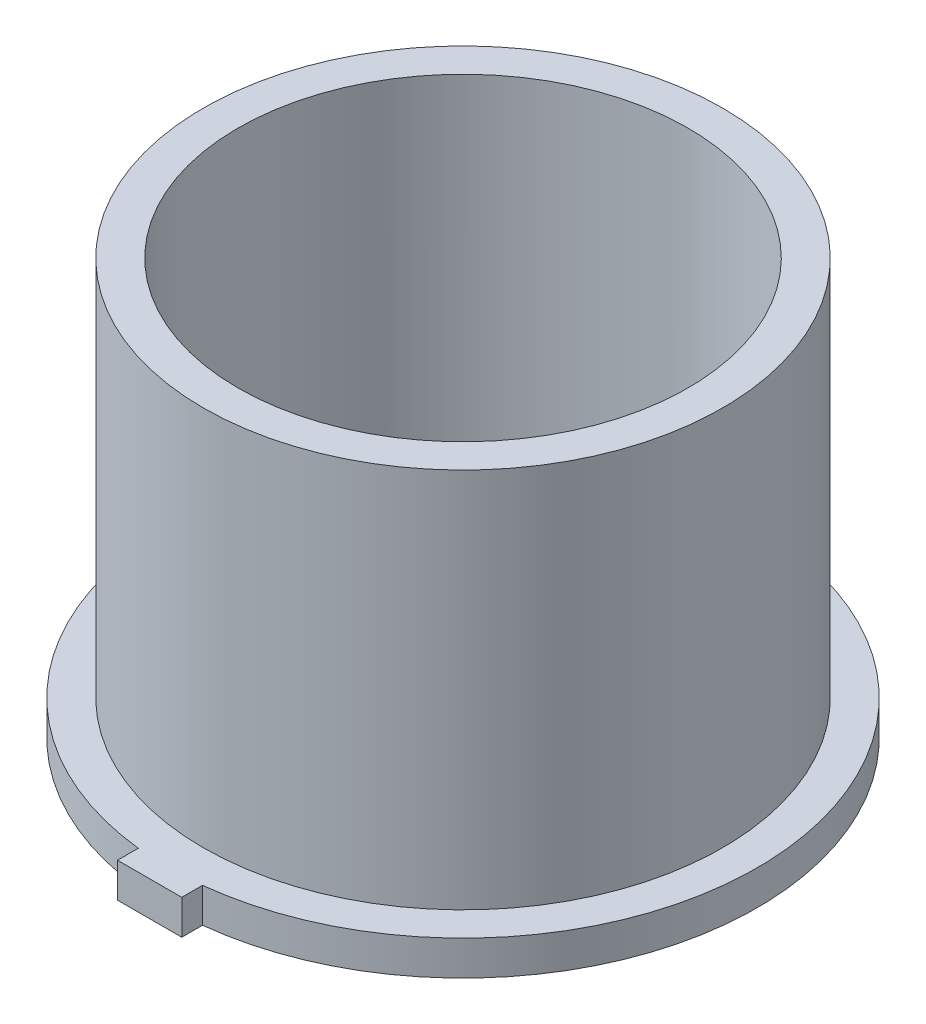
ISO-10303-21;
HEADER;
FILE_DESCRIPTION(('STEP AP214'),'2;1');
FILE_NAME('part.step','',(''),(''),'','','');
FILE_SCHEMA(('AUTOMOTIVE_DESIGN { 1 0 10303 214 1 1 1 1 }'));
ENDSEC;
DATA;
#1=APPLICATION_CONTEXT('core data for automotive mechanical design processes');
#2=APPLICATION_PROTOCOL_DEFINITION('international standard','automotive_design',2000,#1);
#3=PRODUCT_CONTEXT('',#1,'mechanical');
#4=PRODUCT('Part','Part','',(#3));
#5=PRODUCT_RELATED_PRODUCT_CATEGORY('part','',(#4));
#6=PRODUCT_DEFINITION_FORMATION('','',#4);
#7=PRODUCT_DEFINITION_CONTEXT('part definition',#1,'design');
#8=PRODUCT_DEFINITION('design','',#6,#7);
#9=PRODUCT_DEFINITION_SHAPE('','',#8);
#10=(LENGTH_UNIT() NAMED_UNIT(*) SI_UNIT(.MILLI.,.METRE.));
#11=(NAMED_UNIT(*) PLANE_ANGLE_UNIT() SI_UNIT($,.RADIAN.));
#12=(NAMED_UNIT(*) SI_UNIT($,.STERADIAN.) SOLID_ANGLE_UNIT());
#13=UNCERTAINTY_MEASURE_WITH_UNIT(LENGTH_MEASURE(1.E-05),#10,'distance_accuracy_value','');
#14=(GEOMETRIC_REPRESENTATION_CONTEXT(3) GLOBAL_UNCERTAINTY_ASSIGNED_CONTEXT((#13)) GLOBAL_UNIT_ASSIGNED_CONTEXT((#10,
#11,#12)) REPRESENTATION_CONTEXT('',''));
#15=CARTESIAN_POINT('',(0.,0.,0.));
#16=DIRECTION('',(0.,0.,1.));
#17=DIRECTION('',(1.,0.,0.));
#18=AXIS2_PLACEMENT_3D('',#15,#16,#17);
#19=CARTESIAN_POINT('',(0.,5.,0.));
#20=DIRECTION('',(0.,1.,0.));
#21=DIRECTION('',(0.,0.,1.));
#22=AXIS2_PLACEMENT_3D('',#19,#20,#21);
#23=PLANE('',#22);
#24=DIRECTION('',(0.5,0.,0.866025403784439));
#25=VECTOR('',#24,1.);
#26=CARTESIAN_POINT('',(3.75277674973257,5.,-6.5));
#27=LINE('',#26,#25);
#28=CARTESIAN_POINT('',(3.75277674973257,5.,-6.5));
#29=VERTEX_POINT('',#28);
#30=CARTESIAN_POINT('',(7.50555349946514,5.,0.));
#31=VERTEX_POINT('',#30);
#32=EDGE_CURVE('E257',#29,#31,#27,.T.);
#33=ORIENTED_EDGE('',*,*,#32,.T.);
#34=DIRECTION('',(-0.5,0.,0.866025403784439));
#35=VECTOR('',#34,1.);
#36=CARTESIAN_POINT('',(7.50555349946514,5.,0.));
#37=LINE('',#36,#35);
#38=CARTESIAN_POINT('',(3.75277674973257,5.,6.5));
#39=VERTEX_POINT('',#38);
#40=EDGE_CURVE('E260',#31,#39,#37,.T.);
#41=ORIENTED_EDGE('',*,*,#40,.T.);
#42=DIRECTION('',(-1.,0.,0.));
#43=VECTOR('',#42,1.);
#44=CARTESIAN_POINT('',(3.75277674973257,5.,6.5));
#45=LINE('',#44,#43);
#46=CARTESIAN_POINT('',(-3.75277674973257,5.,6.5));
#47=VERTEX_POINT('',#46);
#48=EDGE_CURVE('E51',#39,#47,#45,.T.);
#49=ORIENTED_EDGE('',*,*,#48,.T.);
#50=DIRECTION('',(-0.5,0.,-0.866025403784439));
#51=VECTOR('',#50,1.);
#52=CARTESIAN_POINT('',(-3.75277674973257,5.,6.5));
#53=LINE('',#52,#51);
#54=CARTESIAN_POINT('',(-7.50555349946513,5.,0.));
#55=VERTEX_POINT('',#54);
#56=EDGE_CURVE('E265',#47,#55,#53,.T.);
#57=ORIENTED_EDGE('',*,*,#56,.T.);
#58=DIRECTION('',(0.5,0.,-0.866025403784439));
#59=VECTOR('',#58,1.);
#60=CARTESIAN_POINT('',(-7.50555349946513,5.,0.));
#61=LINE('',#60,#59);
#62=CARTESIAN_POINT('',(-3.75277674973257,5.,-6.5));
#63=VERTEX_POINT('',#62);
#64=EDGE_CURVE('E268',#55,#63,#61,.T.);
#65=ORIENTED_EDGE('',*,*,#64,.T.);
#66=DIRECTION('',(1.,0.,0.));
#67=VECTOR('',#66,1.);
#68=CARTESIAN_POINT('',(-3.75277674973257,5.,-6.5));
#69=LINE('',#68,#67);
#70=EDGE_CURVE('E271',#63,#29,#69,.T.);
#71=ORIENTED_EDGE('',*,*,#70,.T.);
#72=EDGE_LOOP('',(#33,#41,#49,#57,#65,#71));
#73=FACE_BOUND('',#72,.T.);
#74=CARTESIAN_POINT('',(0.,5.,0.));
#75=DIRECTION('',(0.,1.,0.));
#76=DIRECTION('',(0.,0.,1.));
#77=AXIS2_PLACEMENT_3D('',#74,#75,#76);
#78=CIRCLE('',#77,32.5);
#79=CARTESIAN_POINT('',(-4.63627719035668,5.,-32.1676069021955));
#80=VERTEX_POINT('',#79);
#81=CARTESIAN_POINT('',(4.63627719035667,5.,-32.1676069021956));
#82=VERTEX_POINT('',#81);
#83=EDGE_CURVE('E248',#80,#82,#78,.F.);
#84=ORIENTED_EDGE('',*,*,#83,.F.);
#85=DIRECTION('',(0.,0.,-1.));
#86=VECTOR('',#85,1.);
#87=CARTESIAN_POINT('',(-4.63627719035668,5.,-32.1676069021955));
#88=LINE('',#87,#86);
#89=CARTESIAN_POINT('',(-4.63627719035668,5.,-9.00000000000001));
#90=VERTEX_POINT('',#89);
#91=EDGE_CURVE('E310',#90,#80,#88,.T.);
#92=ORIENTED_EDGE('',*,*,#91,.F.);
#93=DIRECTION('',(1.,0.,0.));
#94=VECTOR('',#93,1.);
#95=CARTESIAN_POINT('',(-4.63627719035668,5.,-9.00000000000001));
#96=LINE('',#95,#94);
#97=CARTESIAN_POINT('',(-5.19615242270663,5.,-9.));
#98=VERTEX_POINT('',#97);
#99=EDGE_CURVE('E307',#98,#90,#96,.T.);
#100=ORIENTED_EDGE('',*,*,#99,.F.);
#101=DIRECTION('',(0.5,0.,-0.866025403784438));
#102=VECTOR('',#101,1.);
#103=CARTESIAN_POINT('',(-5.19615242270663,5.,-9.));
#104=LINE('',#103,#102);
#105=CARTESIAN_POINT('',(-10.3923048454133,5.,0.));
#106=VERTEX_POINT('',#105);
#107=EDGE_CURVE('E305',#106,#98,#104,.T.);
#108=ORIENTED_EDGE('',*,*,#107,.F.);
#109=DIRECTION('',(-0.5,0.,-0.866025403784439));
#110=VECTOR('',#109,1.);
#111=CARTESIAN_POINT('',(-10.3923048454133,5.,0.));
#112=LINE('',#111,#110);
#113=CARTESIAN_POINT('',(-5.19615242270664,5.,9.));
#114=VERTEX_POINT('',#113);
#115=EDGE_CURVE('E303',#114,#106,#112,.T.);
#116=ORIENTED_EDGE('',*,*,#115,.F.);
#117=DIRECTION('',(-1.,0.,0.));
#118=VECTOR('',#117,1.);
#119=CARTESIAN_POINT('',(-5.19615242270664,5.,9.));
#120=LINE('',#119,#118);
#121=CARTESIAN_POINT('',(-4.63627719035668,5.,9.));
#122=VERTEX_POINT('',#121);
#123=EDGE_CURVE('E227',#122,#114,#120,.T.);
#124=ORIENTED_EDGE('',*,*,#123,.F.);
#125=DIRECTION('',(0.,0.,-1.));
#126=VECTOR('',#125,1.);
#127=CARTESIAN_POINT('',(-4.63627719035668,5.,9.));
#128=LINE('',#127,#126);
#129=CARTESIAN_POINT('',(-4.63627719035668,5.,32.1676069021955));
#130=VERTEX_POINT('',#129);
#131=EDGE_CURVE('E220',#130,#122,#128,.T.);
#132=ORIENTED_EDGE('',*,*,#131,.F.);
#133=CARTESIAN_POINT('',(4.63627719035668,5.,32.1676069021955));
#134=VERTEX_POINT('',#133);
#135=EDGE_CURVE('E224',#134,#130,#78,.F.);
#136=ORIENTED_EDGE('',*,*,#135,.F.);
#137=DIRECTION('',(0.,0.,1.));
#138=VECTOR('',#137,1.);
#139=CARTESIAN_POINT('',(4.63627719035668,5.,9.));
#140=LINE('',#139,#138);
#141=CARTESIAN_POINT('',(4.63627719035668,5.,9.));
#142=VERTEX_POINT('',#141);
#143=EDGE_CURVE('E343',#142,#134,#140,.T.);
#144=ORIENTED_EDGE('',*,*,#143,.F.);
#145=DIRECTION('',(-1.,0.,0.));
#146=VECTOR('',#145,1.);
#147=CARTESIAN_POINT('',(4.63627719035668,5.,9.));
#148=LINE('',#147,#146);
#149=CARTESIAN_POINT('',(5.19615242270663,5.,9.));
#150=VERTEX_POINT('',#149);
#151=EDGE_CURVE('E341',#150,#142,#148,.T.);
#152=ORIENTED_EDGE('',*,*,#151,.F.);
#153=DIRECTION('',(-0.5,0.,0.866025403784439));
#154=VECTOR('',#153,1.);
#155=CARTESIAN_POINT('',(5.19615242270663,5.,9.));
#156=LINE('',#155,#154);
#157=CARTESIAN_POINT('',(10.3923048454133,5.,0.));
#158=VERTEX_POINT('',#157);
#159=EDGE_CURVE('E353',#158,#150,#156,.T.);
#160=ORIENTED_EDGE('',*,*,#159,.F.);
#161=DIRECTION('',(0.5,0.,0.866025403784439));
#162=VECTOR('',#161,1.);
#163=CARTESIAN_POINT('',(10.3923048454133,5.,0.));
#164=LINE('',#163,#162);
#165=CARTESIAN_POINT('',(5.19615242270664,5.,-9.));
#166=VERTEX_POINT('',#165);
#167=EDGE_CURVE('E350',#166,#158,#164,.T.);
#168=ORIENTED_EDGE('',*,*,#167,.F.);
#169=DIRECTION('',(1.,0.,0.));
#170=VECTOR('',#169,1.);
#171=CARTESIAN_POINT('',(5.19615242270664,5.,-9.));
#172=LINE('',#171,#170);
#173=CARTESIAN_POINT('',(4.63627719035668,5.,-9.00000000000001));
#174=VERTEX_POINT('',#173);
#175=EDGE_CURVE('E348',#174,#166,#172,.T.);
#176=ORIENTED_EDGE('',*,*,#175,.F.);
#177=DIRECTION('',(0.,0.,1.));
#178=VECTOR('',#177,1.);
#179=CARTESIAN_POINT('',(4.63627719035668,5.,-32.1676069021955));
#180=LINE('',#179,#178);
#181=EDGE_CURVE('E346',#82,#174,#180,.T.);
#182=ORIENTED_EDGE('',*,*,#181,.F.);
#183=EDGE_LOOP('',(#84,#92,#100,#108,#116,#124,#132,#136,#144,#152,#160,#168,#176,#182));
#184=FACE_BOUND('',#183,.T.);
#185=ADVANCED_FACE('F36',(#73,#184),#23,.T.);
#186=CARTESIAN_POINT('',(0.,5.,0.));
#187=DIRECTION('',(0.,1.,0.));
#188=DIRECTION('',(0.,0.,1.));
#189=AXIS2_PLACEMENT_3D('',#186,#187,#188);
#190=CIRCLE('',#189,37.5);
#191=CARTESIAN_POINT('',(0.,5.,37.5));
#192=VERTEX_POINT('',#191);
#193=EDGE_CURVE('E247',#192,#192,#190,.F.);
#194=ORIENTED_EDGE('',*,*,#193,.T.);
#195=EDGE_LOOP('',(#194));
#196=FACE_BOUND('',#195,.T.);
#197=CARTESIAN_POINT('',(0.,5.,0.));
#198=DIRECTION('',(0.,1.,0.));
#199=DIRECTION('',(0.,0.,1.));
#200=AXIS2_PLACEMENT_3D('',#197,#198,#199);
#201=CIRCLE('',#200,42.5);
#202=CARTESIAN_POINT('',(-4.63627719035671,5.,-42.246360006682));
#203=VERTEX_POINT('',#202);
#204=CARTESIAN_POINT('',(-4.63627719035668,5.,42.246360006682));
#205=VERTEX_POINT('',#204);
#206=EDGE_CURVE('E390',#203,#205,#201,.T.);
#207=ORIENTED_EDGE('',*,*,#206,.T.);
#208=DIRECTION('',(0.,0.,1.));
#209=VECTOR('',#208,1.);
#210=CARTESIAN_POINT('',(-4.63627719035668,5.,42.246360006682));
#211=LINE('',#210,#209);
#212=CARTESIAN_POINT('',(-4.63627719035668,5.,45.246360006682));
#213=VERTEX_POINT('',#212);
#214=EDGE_CURVE('E393',#205,#213,#211,.T.);
#215=ORIENTED_EDGE('',*,*,#214,.T.);
#216=DIRECTION('',(1.,0.,0.));
#217=VECTOR('',#216,1.);
#218=CARTESIAN_POINT('',(-4.63627719035668,5.,45.246360006682));
#219=LINE('',#218,#217);
#220=CARTESIAN_POINT('',(4.63627719035668,5.,45.246360006682));
#221=VERTEX_POINT('',#220);
#222=EDGE_CURVE('E396',#213,#221,#219,.T.);
#223=ORIENTED_EDGE('',*,*,#222,.T.);
#224=DIRECTION('',(0.,0.,-1.));
#225=VECTOR('',#224,1.);
#226=CARTESIAN_POINT('',(4.63627719035668,5.,45.246360006682));
#227=LINE('',#226,#225);
#228=CARTESIAN_POINT('',(4.63627719035668,5.,42.246360006682));
#229=VERTEX_POINT('',#228);
#230=EDGE_CURVE('E398',#221,#229,#227,.T.);
#231=ORIENTED_EDGE('',*,*,#230,.T.);
#232=CARTESIAN_POINT('',(0.,5.,0.));
#233=DIRECTION('',(0.,1.,0.));
#234=DIRECTION('',(0.,0.,1.));
#235=AXIS2_PLACEMENT_3D('',#232,#233,#234);
#236=CIRCLE('',#235,42.5);
#237=CARTESIAN_POINT('',(4.63627719035664,5.,-42.246360006682));
#238=VERTEX_POINT('',#237);
#239=EDGE_CURVE('E400',#229,#238,#236,.T.);
#240=ORIENTED_EDGE('',*,*,#239,.T.);
#241=DIRECTION('',(0.,0.,-1.));
#242=VECTOR('',#241,1.);
#243=CARTESIAN_POINT('',(4.63627719035668,5.,-45.246360006682));
#244=LINE('',#243,#242);
#245=CARTESIAN_POINT('',(4.63627719035668,5.,-45.246360006682));
#246=VERTEX_POINT('',#245);
#247=EDGE_CURVE('E402',#238,#246,#244,.T.);
#248=ORIENTED_EDGE('',*,*,#247,.T.);
#249=DIRECTION('',(-1.,0.,0.));
#250=VECTOR('',#249,1.);
#251=CARTESIAN_POINT('',(-4.63627719035668,5.,-45.246360006682));
#252=LINE('',#251,#250);
#253=CARTESIAN_POINT('',(-4.63627719035668,5.,-45.246360006682));
#254=VERTEX_POINT('',#253);
#255=EDGE_CURVE('E404',#246,#254,#252,.T.);
#256=ORIENTED_EDGE('',*,*,#255,.T.);
#257=DIRECTION('',(0.,0.,1.));
#258=VECTOR('',#257,1.);
#259=CARTESIAN_POINT('',(-4.63627719035671,5.,-42.246360006682));
#260=LINE('',#259,#258);
#261=EDGE_CURVE('E406',#254,#203,#260,.T.);
#262=ORIENTED_EDGE('',*,*,#261,.T.);
#263=EDGE_LOOP('',(#207,#215,#223,#231,#240,#248,#256,#262));
#264=FACE_BOUND('',#263,.T.);
#265=ADVANCED_FACE('F465',(#196,#264),#23,.T.);
#266=CARTESIAN_POINT('',(0.,0.,0.));
#267=DIRECTION('',(0.,1.,0.));
#268=DIRECTION('',(0.,0.,1.));
#269=AXIS2_PLACEMENT_3D('',#266,#267,#268);
#270=PLANE('',#269);
#271=CARTESIAN_POINT('',(0.,0.,0.));
#272=DIRECTION('',(0.,1.,0.));
#273=DIRECTION('',(0.,0.,1.));
#274=AXIS2_PLACEMENT_3D('',#271,#272,#273);
#275=CIRCLE('',#274,42.5);
#276=CARTESIAN_POINT('',(-4.63627719035671,0.,-42.246360006682));
#277=VERTEX_POINT('',#276);
#278=CARTESIAN_POINT('',(-4.63627719035668,0.,42.246360006682));
#279=VERTEX_POINT('',#278);
#280=EDGE_CURVE('E389',#277,#279,#275,.T.);
#281=ORIENTED_EDGE('',*,*,#280,.F.);
#282=DIRECTION('',(0.,0.,1.));
#283=VECTOR('',#282,1.);
#284=CARTESIAN_POINT('',(-4.63627719035671,0.,-42.246360006682));
#285=LINE('',#284,#283);
#286=CARTESIAN_POINT('',(-4.63627719035668,0.,-45.246360006682));
#287=VERTEX_POINT('',#286);
#288=EDGE_CURVE('E394',#287,#277,#285,.T.);
#289=ORIENTED_EDGE('',*,*,#288,.F.);
#290=DIRECTION('',(-1.,0.,0.));
#291=VECTOR('',#290,1.);
#292=CARTESIAN_POINT('',(-4.63627719035668,0.,-45.246360006682));
#293=LINE('',#292,#291);
#294=CARTESIAN_POINT('',(4.63627719035668,0.,-45.246360006682));
#295=VERTEX_POINT('',#294);
#296=EDGE_CURVE('E421',#295,#287,#293,.T.);
#297=ORIENTED_EDGE('',*,*,#296,.F.);
#298=DIRECTION('',(0.,0.,-1.));
#299=VECTOR('',#298,1.);
#300=CARTESIAN_POINT('',(4.63627719035668,0.,-45.246360006682));
#301=LINE('',#300,#299);
#302=CARTESIAN_POINT('',(4.63627719035664,0.,-42.246360006682));
#303=VERTEX_POINT('',#302);
#304=EDGE_CURVE('E419',#303,#295,#301,.T.);
#305=ORIENTED_EDGE('',*,*,#304,.F.);
#306=CARTESIAN_POINT('',(0.,0.,0.));
#307=DIRECTION('',(0.,1.,0.));
#308=DIRECTION('',(0.,0.,1.));
#309=AXIS2_PLACEMENT_3D('',#306,#307,#308);
#310=CIRCLE('',#309,42.5);
#311=CARTESIAN_POINT('',(4.63627719035668,0.,42.246360006682));
#312=VERTEX_POINT('',#311);
#313=EDGE_CURVE('E417',#312,#303,#310,.T.);
#314=ORIENTED_EDGE('',*,*,#313,.F.);
#315=DIRECTION('',(0.,0.,-1.));
#316=VECTOR('',#315,1.);
#317=CARTESIAN_POINT('',(4.63627719035668,0.,45.246360006682));
#318=LINE('',#317,#316);
#319=CARTESIAN_POINT('',(4.63627719035668,0.,45.246360006682));
#320=VERTEX_POINT('',#319);
#321=EDGE_CURVE('E415',#320,#312,#318,.T.);
#322=ORIENTED_EDGE('',*,*,#321,.F.);
#323=DIRECTION('',(1.,0.,0.));
#324=VECTOR('',#323,1.);
#325=CARTESIAN_POINT('',(-4.63627719035668,0.,45.246360006682));
#326=LINE('',#325,#324);
#327=CARTESIAN_POINT('',(-4.63627719035668,0.,45.246360006682));
#328=VERTEX_POINT('',#327);
#329=EDGE_CURVE('E413',#328,#320,#326,.T.);
#330=ORIENTED_EDGE('',*,*,#329,.F.);
#331=DIRECTION('',(0.,0.,1.));
#332=VECTOR('',#331,1.);
#333=CARTESIAN_POINT('',(-4.63627719035668,0.,42.246360006682));
#334=LINE('',#333,#332);
#335=EDGE_CURVE('E411',#279,#328,#334,.T.);
#336=ORIENTED_EDGE('',*,*,#335,.F.);
#337=EDGE_LOOP('',(#281,#289,#297,#305,#314,#322,#330,#336));
#338=FACE_BOUND('',#337,.T.);
#339=CARTESIAN_POINT('',(0.,0.,0.));
#340=DIRECTION('',(0.,1.,0.));
#341=DIRECTION('',(0.,0.,1.));
#342=AXIS2_PLACEMENT_3D('',#339,#340,#341);
#343=CIRCLE('',#342,32.5);
#344=CARTESIAN_POINT('',(4.63627719035668,0.,32.1676069021955));
#345=VERTEX_POINT('',#344);
#346=CARTESIAN_POINT('',(4.63627719035667,0.,-32.1676069021956));
#347=VERTEX_POINT('',#346);
#348=EDGE_CURVE('E361',#345,#347,#343,.T.);
#349=ORIENTED_EDGE('',*,*,#348,.T.);
#350=DIRECTION('',(0.,0.,1.));
#351=VECTOR('',#350,1.);
#352=CARTESIAN_POINT('',(4.63627719035668,0.,-32.1676069021955));
#353=LINE('',#352,#351);
#354=CARTESIAN_POINT('',(4.63627719035668,0.,-9.00000000000001));
#355=VERTEX_POINT('',#354);
#356=EDGE_CURVE('E364',#347,#355,#353,.T.);
#357=ORIENTED_EDGE('',*,*,#356,.T.);
#358=DIRECTION('',(1.,0.,0.));
#359=VECTOR('',#358,1.);
#360=CARTESIAN_POINT('',(5.19615242270664,0.,-9.));
#361=LINE('',#360,#359);
#362=CARTESIAN_POINT('',(5.19615242270664,0.,-9.));
#363=VERTEX_POINT('',#362);
#364=EDGE_CURVE('E367',#355,#363,#361,.T.);
#365=ORIENTED_EDGE('',*,*,#364,.T.);
#366=DIRECTION('',(0.5,0.,0.866025403784439));
#367=VECTOR('',#366,1.);
#368=CARTESIAN_POINT('',(10.3923048454133,0.,0.));
#369=LINE('',#368,#367);
#370=CARTESIAN_POINT('',(10.3923048454133,0.,0.));
#371=VERTEX_POINT('',#370);
#372=EDGE_CURVE('E370',#363,#371,#369,.T.);
#373=ORIENTED_EDGE('',*,*,#372,.T.);
#374=DIRECTION('',(-0.5,0.,0.866025403784439));
#375=VECTOR('',#374,1.);
#376=CARTESIAN_POINT('',(5.19615242270663,0.,9.));
#377=LINE('',#376,#375);
#378=CARTESIAN_POINT('',(5.19615242270663,0.,9.));
#379=VERTEX_POINT('',#378);
#380=EDGE_CURVE('E344',#371,#379,#377,.T.);
#381=ORIENTED_EDGE('',*,*,#380,.T.);
#382=DIRECTION('',(-1.,0.,0.));
#383=VECTOR('',#382,1.);
#384=CARTESIAN_POINT('',(4.63627719035668,0.,9.));
#385=LINE('',#384,#383);
#386=CARTESIAN_POINT('',(4.63627719035668,0.,9.));
#387=VERTEX_POINT('',#386);
#388=EDGE_CURVE('E239',#379,#387,#385,.T.);
#389=ORIENTED_EDGE('',*,*,#388,.T.);
#390=DIRECTION('',(0.,0.,1.));
#391=VECTOR('',#390,1.);
#392=CARTESIAN_POINT('',(4.63627719035668,0.,9.));
#393=LINE('',#392,#391);
#394=EDGE_CURVE('E358',#387,#345,#393,.T.);
#395=ORIENTED_EDGE('',*,*,#394,.T.);
#396=EDGE_LOOP('',(#349,#357,#365,#373,#381,#389,#395));
#397=FACE_BOUND('',#396,.T.);
#398=DIRECTION('',(-0.5,0.,0.866025403784439));
#399=VECTOR('',#398,1.);
#400=CARTESIAN_POINT('',(7.50555349946514,0.,0.));
#401=LINE('',#400,#399);
#402=CARTESIAN_POINT('',(7.50555349946514,0.,0.));
#403=VERTEX_POINT('',#402);
#404=CARTESIAN_POINT('',(3.75277674973257,0.,6.5));
#405=VERTEX_POINT('',#404);
#406=EDGE_CURVE('E276',#403,#405,#401,.T.);
#407=ORIENTED_EDGE('',*,*,#406,.F.);
#408=DIRECTION('',(0.5,0.,0.866025403784439));
#409=VECTOR('',#408,1.);
#410=CARTESIAN_POINT('',(3.75277674973257,0.,-6.5));
#411=LINE('',#410,#409);
#412=CARTESIAN_POINT('',(3.75277674973257,0.,-6.5));
#413=VERTEX_POINT('',#412);
#414=EDGE_CURVE('E59',#413,#403,#411,.T.);
#415=ORIENTED_EDGE('',*,*,#414,.F.);
#416=DIRECTION('',(1.,0.,0.));
#417=VECTOR('',#416,1.);
#418=CARTESIAN_POINT('',(-3.75277674973257,0.,-6.5));
#419=LINE('',#418,#417);
#420=CARTESIAN_POINT('',(-3.75277674973257,0.,-6.5));
#421=VERTEX_POINT('',#420);
#422=EDGE_CURVE('E261',#421,#413,#419,.T.);
#423=ORIENTED_EDGE('',*,*,#422,.F.);
#424=DIRECTION('',(0.5,0.,-0.866025403784439));
#425=VECTOR('',#424,1.);
#426=CARTESIAN_POINT('',(-7.50555349946513,0.,0.));
#427=LINE('',#426,#425);
#428=CARTESIAN_POINT('',(-7.50555349946513,0.,0.));
#429=VERTEX_POINT('',#428);
#430=EDGE_CURVE('E285',#429,#421,#427,.T.);
#431=ORIENTED_EDGE('',*,*,#430,.F.);
#432=DIRECTION('',(-0.5,0.,-0.866025403784439));
#433=VECTOR('',#432,1.);
#434=CARTESIAN_POINT('',(-3.75277674973257,0.,6.5));
#435=LINE('',#434,#433);
#436=CARTESIAN_POINT('',(-3.75277674973257,0.,6.5));
#437=VERTEX_POINT('',#436);
#438=EDGE_CURVE('E282',#437,#429,#435,.T.);
#439=ORIENTED_EDGE('',*,*,#438,.F.);
#440=DIRECTION('',(-1.,0.,0.));
#441=VECTOR('',#440,1.);
#442=CARTESIAN_POINT('',(3.75277674973257,0.,6.5));
#443=LINE('',#442,#441);
#444=EDGE_CURVE('E279',#405,#437,#443,.T.);
#445=ORIENTED_EDGE('',*,*,#444,.F.);
#446=EDGE_LOOP('',(#407,#415,#423,#431,#439,#445));
#447=FACE_BOUND('',#446,.T.);
#448=DIRECTION('',(0.,0.,-1.));
#449=VECTOR('',#448,1.);
#450=CARTESIAN_POINT('',(-4.63627719035668,0.,-32.1676069021955));
#451=LINE('',#450,#449);
#452=CARTESIAN_POINT('',(-4.63627719035668,0.,-9.00000000000001));
#453=VERTEX_POINT('',#452);
#454=CARTESIAN_POINT('',(-4.63627719035668,0.,-32.1676069021955));
#455=VERTEX_POINT('',#454);
#456=EDGE_CURVE('E230',#453,#455,#451,.T.);
#457=ORIENTED_EDGE('',*,*,#456,.T.);
#458=CARTESIAN_POINT('',(0.,0.,0.));
#459=DIRECTION('',(0.,1.,0.));
#460=DIRECTION('',(0.,0.,1.));
#461=AXIS2_PLACEMENT_3D('',#458,#459,#460);
#462=CIRCLE('',#461,32.5);
#463=CARTESIAN_POINT('',(-4.63627719035668,0.,32.1676069021955));
#464=VERTEX_POINT('',#463);
#465=EDGE_CURVE('E292',#455,#464,#462,.T.);
#466=ORIENTED_EDGE('',*,*,#465,.T.);
#467=DIRECTION('',(0.,0.,-1.));
#468=VECTOR('',#467,1.);
#469=CARTESIAN_POINT('',(-4.63627719035668,0.,9.));
#470=LINE('',#469,#468);
#471=CARTESIAN_POINT('',(-4.63627719035668,0.,9.));
#472=VERTEX_POINT('',#471);
#473=EDGE_CURVE('E236',#464,#472,#470,.T.);
#474=ORIENTED_EDGE('',*,*,#473,.T.);
#475=DIRECTION('',(-1.,0.,0.));
#476=VECTOR('',#475,1.);
#477=CARTESIAN_POINT('',(-5.19615242270664,0.,9.));
#478=LINE('',#477,#476);
#479=CARTESIAN_POINT('',(-5.19615242270664,0.,9.));
#480=VERTEX_POINT('',#479);
#481=EDGE_CURVE('E316',#472,#480,#478,.T.);
#482=ORIENTED_EDGE('',*,*,#481,.T.);
#483=DIRECTION('',(-0.5,0.,-0.866025403784439));
#484=VECTOR('',#483,1.);
#485=CARTESIAN_POINT('',(-10.3923048454133,0.,0.));
#486=LINE('',#485,#484);
#487=CARTESIAN_POINT('',(-10.3923048454133,0.,0.));
#488=VERTEX_POINT('',#487);
#489=EDGE_CURVE('E319',#480,#488,#486,.T.);
#490=ORIENTED_EDGE('',*,*,#489,.T.);
#491=DIRECTION('',(0.5,0.,-0.866025403784438));
#492=VECTOR('',#491,1.);
#493=CARTESIAN_POINT('',(-5.19615242270663,0.,-9.));
#494=LINE('',#493,#492);
#495=CARTESIAN_POINT('',(-5.19615242270663,0.,-9.));
#496=VERTEX_POINT('',#495);
#497=EDGE_CURVE('E322',#488,#496,#494,.T.);
#498=ORIENTED_EDGE('',*,*,#497,.T.);
#499=DIRECTION('',(1.,0.,0.));
#500=VECTOR('',#499,1.);
#501=CARTESIAN_POINT('',(-4.63627719035668,0.,-9.00000000000001));
#502=LINE('',#501,#500);
#503=EDGE_CURVE('E325',#496,#453,#502,.T.);
#504=ORIENTED_EDGE('',*,*,#503,.T.);
#505=EDGE_LOOP('',(#457,#466,#474,#482,#490,#498,#504));
#506=FACE_BOUND('',#505,.T.);
#507=ADVANCED_FACE('F451',(#338,#397,#447,#506),#270,.F.);
#508=CARTESIAN_POINT('',(0.,5.,0.));
#509=DIRECTION('',(0.,-1.,0.));
#510=DIRECTION('',(0.,0.,-1.));
#511=AXIS2_PLACEMENT_3D('',#508,#509,#510);
#512=CYLINDRICAL_SURFACE('',#511,42.5);
#513=ORIENTED_EDGE('',*,*,#280,.T.);
#514=DIRECTION('',(0.,-1.,0.));
#515=VECTOR('',#514,1.);
#516=CARTESIAN_POINT('',(-4.63627719035668,5.,42.246360006682));
#517=LINE('',#516,#515);
#518=EDGE_CURVE('E11',#205,#279,#517,.T.);
#519=ORIENTED_EDGE('',*,*,#518,.F.);
#520=ORIENTED_EDGE('',*,*,#206,.F.);
#521=DIRECTION('',(0.,-1.,0.));
#522=VECTOR('',#521,1.);
#523=CARTESIAN_POINT('',(-4.63627719035671,5.,-42.246360006682));
#524=LINE('',#523,#522);
#525=EDGE_CURVE('E408',#203,#277,#524,.T.);
#526=ORIENTED_EDGE('',*,*,#525,.T.);
#527=EDGE_LOOP('',(#513,#519,#520,#526));
#528=FACE_BOUND('',#527,.T.);
#529=ADVANCED_FACE('F38',(#528),#512,.T.);
#530=CARTESIAN_POINT('',(-4.63627719035668,5.,42.246360006682));
#531=DIRECTION('',(1.,0.,0.));
#532=DIRECTION('',(0.,0.,-1.));
#533=AXIS2_PLACEMENT_3D('',#530,#531,#532);
#534=PLANE('',#533);
#535=ORIENTED_EDGE('',*,*,#335,.T.);
#536=DIRECTION('',(0.,-1.,0.));
#537=VECTOR('',#536,1.);
#538=CARTESIAN_POINT('',(-4.63627719035668,5.,45.246360006682));
#539=LINE('',#538,#537);
#540=EDGE_CURVE('E44',#213,#328,#539,.T.);
#541=ORIENTED_EDGE('',*,*,#540,.F.);
#542=ORIENTED_EDGE('',*,*,#214,.F.);
#543=ORIENTED_EDGE('',*,*,#518,.T.);
#544=EDGE_LOOP('',(#535,#541,#542,#543));
#545=FACE_BOUND('',#544,.T.);
#546=ADVANCED_FACE('F469',(#545),#534,.F.);
#547=CARTESIAN_POINT('',(-4.63627719035668,5.,45.246360006682));
#548=DIRECTION('',(0.,0.,-1.));
#549=DIRECTION('',(-1.,0.,0.));
#550=AXIS2_PLACEMENT_3D('',#547,#548,#549);
#551=PLANE('',#550);
#552=ORIENTED_EDGE('',*,*,#329,.T.);
#553=DIRECTION('',(0.,-1.,0.));
#554=VECTOR('',#553,1.);
#555=CARTESIAN_POINT('',(4.63627719035668,5.,45.246360006682));
#556=LINE('',#555,#554);
#557=EDGE_CURVE('E438',#221,#320,#556,.T.);
#558=ORIENTED_EDGE('',*,*,#557,.F.);
#559=ORIENTED_EDGE('',*,*,#222,.F.);
#560=ORIENTED_EDGE('',*,*,#540,.T.);
#561=EDGE_LOOP('',(#552,#558,#559,#560));
#562=FACE_BOUND('',#561,.T.);
#563=ADVANCED_FACE('F445',(#562),#551,.F.);
#564=CARTESIAN_POINT('',(4.63627719035668,5.,45.246360006682));
#565=DIRECTION('',(-1.,0.,0.));
#566=DIRECTION('',(0.,0.,1.));
#567=AXIS2_PLACEMENT_3D('',#564,#565,#566);
#568=PLANE('',#567);
#569=ORIENTED_EDGE('',*,*,#321,.T.);
#570=DIRECTION('',(0.,-1.,0.));
#571=VECTOR('',#570,1.);
#572=CARTESIAN_POINT('',(4.63627719035668,5.,42.246360006682));
#573=LINE('',#572,#571);
#574=EDGE_CURVE('E435',#229,#312,#573,.T.);
#575=ORIENTED_EDGE('',*,*,#574,.F.);
#576=ORIENTED_EDGE('',*,*,#230,.F.);
#577=ORIENTED_EDGE('',*,*,#557,.T.);
#578=EDGE_LOOP('',(#569,#575,#576,#577));
#579=FACE_BOUND('',#578,.T.);
#580=ADVANCED_FACE('F457',(#579),#568,.F.);
#581=CARTESIAN_POINT('',(0.,5.,0.));
#582=DIRECTION('',(0.,-1.,0.));
#583=DIRECTION('',(0.,0.,-1.));
#584=AXIS2_PLACEMENT_3D('',#581,#582,#583);
#585=CYLINDRICAL_SURFACE('',#584,42.5);
#586=ORIENTED_EDGE('',*,*,#313,.T.);
#587=DIRECTION('',(0.,-1.,0.));
#588=VECTOR('',#587,1.);
#589=CARTESIAN_POINT('',(4.63627719035664,5.,-42.246360006682));
#590=LINE('',#589,#588);
#591=EDGE_CURVE('E432',#238,#303,#590,.T.);
#592=ORIENTED_EDGE('',*,*,#591,.F.);
#593=ORIENTED_EDGE('',*,*,#239,.F.);
#594=ORIENTED_EDGE('',*,*,#574,.T.);
#595=EDGE_LOOP('',(#586,#592,#593,#594));
#596=FACE_BOUND('',#595,.T.);
#597=ADVANCED_FACE('F461',(#596),#585,.T.);
#598=CARTESIAN_POINT('',(4.63627719035668,5.,-45.246360006682));
#599=DIRECTION('',(-1.,0.,0.));
#600=DIRECTION('',(0.,0.,1.));
#601=AXIS2_PLACEMENT_3D('',#598,#599,#600);
#602=PLANE('',#601);
#603=ORIENTED_EDGE('',*,*,#304,.T.);
#604=DIRECTION('',(0.,-1.,0.));
#605=VECTOR('',#604,1.);
#606=CARTESIAN_POINT('',(4.63627719035668,5.,-45.246360006682));
#607=LINE('',#606,#605);
#608=EDGE_CURVE('E429',#246,#295,#607,.T.);
#609=ORIENTED_EDGE('',*,*,#608,.F.);
#610=ORIENTED_EDGE('',*,*,#247,.F.);
#611=ORIENTED_EDGE('',*,*,#591,.T.);
#612=EDGE_LOOP('',(#603,#609,#610,#611));
#613=FACE_BOUND('',#612,.T.);
#614=ADVANCED_FACE('F482',(#613),#602,.F.);
#615=CARTESIAN_POINT('',(-4.63627719035668,5.,-45.246360006682));
#616=DIRECTION('',(0.,0.,1.));
#617=DIRECTION('',(1.,0.,0.));
#618=AXIS2_PLACEMENT_3D('',#615,#616,#617);
#619=PLANE('',#618);
#620=ORIENTED_EDGE('',*,*,#296,.T.);
#621=DIRECTION('',(0.,-1.,0.));
#622=VECTOR('',#621,1.);
#623=CARTESIAN_POINT('',(-4.63627719035668,5.,-45.246360006682));
#624=LINE('',#623,#622);
#625=EDGE_CURVE('E426',#254,#287,#624,.T.);
#626=ORIENTED_EDGE('',*,*,#625,.F.);
#627=ORIENTED_EDGE('',*,*,#255,.F.);
#628=ORIENTED_EDGE('',*,*,#608,.T.);
#629=EDGE_LOOP('',(#620,#626,#627,#628));
#630=FACE_BOUND('',#629,.T.);
#631=ADVANCED_FACE('F480',(#630),#619,.F.);
#632=CARTESIAN_POINT('',(-4.63627719035671,5.,-42.246360006682));
#633=DIRECTION('',(1.,0.,0.));
#634=DIRECTION('',(0.,0.,-1.));
#635=AXIS2_PLACEMENT_3D('',#632,#633,#634);
#636=PLANE('',#635);
#637=ORIENTED_EDGE('',*,*,#288,.T.);
#638=ORIENTED_EDGE('',*,*,#525,.F.);
#639=ORIENTED_EDGE('',*,*,#261,.F.);
#640=ORIENTED_EDGE('',*,*,#625,.T.);
#641=EDGE_LOOP('',(#637,#638,#639,#640));
#642=FACE_BOUND('',#641,.T.);
#643=ADVANCED_FACE('F475',(#642),#636,.F.);
#644=CARTESIAN_POINT('',(4.63627719035668,5.,9.));
#645=DIRECTION('',(0.,0.,1.));
#646=DIRECTION('',(1.,0.,0.));
#647=AXIS2_PLACEMENT_3D('',#644,#645,#646);
#648=PLANE('',#647);
#649=ORIENTED_EDGE('',*,*,#388,.F.);
#650=DIRECTION('',(0.,-1.,0.));
#651=VECTOR('',#650,1.);
#652=CARTESIAN_POINT('',(5.19615242270663,5.,9.));
#653=LINE('',#652,#651);
#654=EDGE_CURVE('E355',#150,#379,#653,.T.);
#655=ORIENTED_EDGE('',*,*,#654,.F.);
#656=ORIENTED_EDGE('',*,*,#151,.T.);
#657=DIRECTION('',(0.,-1.,0.));
#658=VECTOR('',#657,1.);
#659=CARTESIAN_POINT('',(4.63627719035668,5.,9.));
#660=LINE('',#659,#658);
#661=EDGE_CURVE('E386',#142,#387,#660,.T.);
#662=ORIENTED_EDGE('',*,*,#661,.T.);
#663=EDGE_LOOP('',(#649,#655,#656,#662));
#664=FACE_BOUND('',#663,.T.);
#665=ADVANCED_FACE('F500',(#664),#648,.T.);
#666=CARTESIAN_POINT('',(4.63627719035668,5.,9.));
#667=DIRECTION('',(1.,0.,0.));
#668=DIRECTION('',(0.,0.,-1.));
#669=AXIS2_PLACEMENT_3D('',#666,#667,#668);
#670=PLANE('',#669);
#671=ORIENTED_EDGE('',*,*,#394,.F.);
#672=ORIENTED_EDGE('',*,*,#661,.F.);
#673=ORIENTED_EDGE('',*,*,#143,.T.);
#674=DIRECTION('',(0.,-1.,0.));
#675=VECTOR('',#674,1.);
#676=CARTESIAN_POINT('',(4.63627719035668,5.,32.1676069021955));
#677=LINE('',#676,#675);
#678=EDGE_CURVE('E246',#134,#345,#677,.T.);
#679=ORIENTED_EDGE('',*,*,#678,.T.);
#680=EDGE_LOOP('',(#671,#672,#673,#679));
#681=FACE_BOUND('',#680,.T.);
#682=ADVANCED_FACE('F508',(#681),#670,.T.);
#683=CARTESIAN_POINT('',(0.,5.,0.));
#684=DIRECTION('',(0.,-1.,0.));
#685=DIRECTION('',(0.,0.,-1.));
#686=AXIS2_PLACEMENT_3D('',#683,#684,#685);
#687=CYLINDRICAL_SURFACE('',#686,32.5);
#688=ORIENTED_EDGE('',*,*,#348,.F.);
#689=ORIENTED_EDGE('',*,*,#678,.F.);
#690=ORIENTED_EDGE('',*,*,#135,.T.);
#691=DIRECTION('',(0.,-1.,0.));
#692=VECTOR('',#691,1.);
#693=CARTESIAN_POINT('',(-4.63627719035668,5.,32.1676069021955));
#694=LINE('',#693,#692);
#695=EDGE_CURVE('E233',#130,#464,#694,.T.);
#696=ORIENTED_EDGE('',*,*,#695,.T.);
#697=ORIENTED_EDGE('',*,*,#465,.F.);
#698=DIRECTION('',(0.,-1.,0.));
#699=VECTOR('',#698,1.);
#700=CARTESIAN_POINT('',(-4.63627719035668,5.,-32.1676069021955));
#701=LINE('',#700,#699);
#702=EDGE_CURVE('E313',#80,#455,#701,.T.);
#703=ORIENTED_EDGE('',*,*,#702,.F.);
#704=ORIENTED_EDGE('',*,*,#83,.T.);
#705=DIRECTION('',(0.,-1.,0.));
#706=VECTOR('',#705,1.);
#707=CARTESIAN_POINT('',(4.63627719035667,5.,-32.1676069021956));
#708=LINE('',#707,#706);
#709=EDGE_CURVE('E383',#82,#347,#708,.T.);
#710=ORIENTED_EDGE('',*,*,#709,.T.);
#711=EDGE_LOOP('',(#688,#689,#690,#696,#697,#703,#704,#710));
#712=FACE_BOUND('',#711,.T.);
#713=CARTESIAN_POINT('',(0.,60.,0.));
#714=DIRECTION('',(0.,1.,0.));
#715=DIRECTION('',(0.,0.,1.));
#716=AXIS2_PLACEMENT_3D('',#713,#714,#715);
#717=CIRCLE('',#716,32.5);
#718=CARTESIAN_POINT('',(0.,60.,32.5));
#719=VERTEX_POINT('',#718);
#720=EDGE_CURVE('E804',#719,#719,#717,.T.);
#721=ORIENTED_EDGE('',*,*,#720,.T.);
#722=EDGE_LOOP('',(#721));
#723=FACE_BOUND('',#722,.T.);
#724=ADVANCED_FACE('F244',(#712,#723),#687,.F.);
#725=CARTESIAN_POINT('',(4.63627719035668,5.,-32.1676069021955));
#726=DIRECTION('',(1.,0.,0.));
#727=DIRECTION('',(0.,0.,-1.));
#728=AXIS2_PLACEMENT_3D('',#725,#726,#727);
#729=PLANE('',#728);
#730=ORIENTED_EDGE('',*,*,#356,.F.);
#731=ORIENTED_EDGE('',*,*,#709,.F.);
#732=ORIENTED_EDGE('',*,*,#181,.T.);
#733=DIRECTION('',(0.,-1.,0.));
#734=VECTOR('',#733,1.);
#735=CARTESIAN_POINT('',(4.63627719035668,5.,-9.00000000000001));
#736=LINE('',#735,#734);
#737=EDGE_CURVE('E381',#174,#355,#736,.T.);
#738=ORIENTED_EDGE('',*,*,#737,.T.);
#739=EDGE_LOOP('',(#730,#731,#732,#738));
#740=FACE_BOUND('',#739,.T.);
#741=ADVANCED_FACE('F533',(#740),#729,.T.);
#742=CARTESIAN_POINT('',(5.19615242270664,5.,-9.));
#743=DIRECTION('',(0.,0.,-1.));
#744=DIRECTION('',(-1.,0.,0.));
#745=AXIS2_PLACEMENT_3D('',#742,#743,#744);
#746=PLANE('',#745);
#747=ORIENTED_EDGE('',*,*,#364,.F.);
#748=ORIENTED_EDGE('',*,*,#737,.F.);
#749=ORIENTED_EDGE('',*,*,#175,.T.);
#750=DIRECTION('',(0.,-1.,0.));
#751=VECTOR('',#750,1.);
#752=CARTESIAN_POINT('',(5.19615242270664,5.,-9.));
#753=LINE('',#752,#751);
#754=EDGE_CURVE('E379',#166,#363,#753,.T.);
#755=ORIENTED_EDGE('',*,*,#754,.T.);
#756=EDGE_LOOP('',(#747,#748,#749,#755));
#757=FACE_BOUND('',#756,.T.);
#758=ADVANCED_FACE('F536',(#757),#746,.T.);
#759=CARTESIAN_POINT('',(10.3923048454133,5.,0.));
#760=DIRECTION('',(0.866025403784439,0.,-0.5));
#761=DIRECTION('',(-0.5,0.,-0.866025403784439));
#762=AXIS2_PLACEMENT_3D('',#759,#760,#761);
#763=PLANE('',#762);
#764=ORIENTED_EDGE('',*,*,#372,.F.);
#765=ORIENTED_EDGE('',*,*,#754,.F.);
#766=ORIENTED_EDGE('',*,*,#167,.T.);
#767=DIRECTION('',(0.,-1.,0.));
#768=VECTOR('',#767,1.);
#769=CARTESIAN_POINT('',(10.3923048454133,5.,0.));
#770=LINE('',#769,#768);
#771=EDGE_CURVE('E377',#158,#371,#770,.T.);
#772=ORIENTED_EDGE('',*,*,#771,.T.);
#773=EDGE_LOOP('',(#764,#765,#766,#772));
#774=FACE_BOUND('',#773,.T.);
#775=ADVANCED_FACE('F526',(#774),#763,.T.);
#776=CARTESIAN_POINT('',(5.19615242270663,5.,9.));
#777=DIRECTION('',(0.866025403784439,0.,0.5));
#778=DIRECTION('',(0.5,0.,-0.866025403784439));
#779=AXIS2_PLACEMENT_3D('',#776,#777,#778);
#780=PLANE('',#779);
#781=ORIENTED_EDGE('',*,*,#380,.F.);
#782=ORIENTED_EDGE('',*,*,#771,.F.);
#783=ORIENTED_EDGE('',*,*,#159,.T.);
#784=ORIENTED_EDGE('',*,*,#654,.T.);
#785=EDGE_LOOP('',(#781,#782,#783,#784));
#786=FACE_BOUND('',#785,.T.);
#787=ADVANCED_FACE('F519',(#786),#780,.T.);
#788=CARTESIAN_POINT('',(-4.63627719035668,5.,9.));
#789=DIRECTION('',(-1.,0.,0.));
#790=DIRECTION('',(0.,0.,1.));
#791=AXIS2_PLACEMENT_3D('',#788,#789,#790);
#792=PLANE('',#791);
#793=ORIENTED_EDGE('',*,*,#473,.F.);
#794=ORIENTED_EDGE('',*,*,#695,.F.);
#795=ORIENTED_EDGE('',*,*,#131,.T.);
#796=DIRECTION('',(0.,-1.,0.));
#797=VECTOR('',#796,1.);
#798=CARTESIAN_POINT('',(-4.63627719035668,5.,9.));
#799=LINE('',#798,#797);
#800=EDGE_CURVE('E240',#122,#472,#799,.T.);
#801=ORIENTED_EDGE('',*,*,#800,.T.);
#802=EDGE_LOOP('',(#793,#794,#795,#801));
#803=FACE_BOUND('',#802,.T.);
#804=ADVANCED_FACE('F234',(#803),#792,.T.);
#805=CARTESIAN_POINT('',(-5.19615242270664,5.,9.));
#806=DIRECTION('',(0.,0.,1.));
#807=DIRECTION('',(1.,0.,0.));
#808=AXIS2_PLACEMENT_3D('',#805,#806,#807);
#809=PLANE('',#808);
#810=ORIENTED_EDGE('',*,*,#481,.F.);
#811=ORIENTED_EDGE('',*,*,#800,.F.);
#812=ORIENTED_EDGE('',*,*,#123,.T.);
#813=DIRECTION('',(0.,-1.,0.));
#814=VECTOR('',#813,1.);
#815=CARTESIAN_POINT('',(-5.19615242270664,5.,9.));
#816=LINE('',#815,#814);
#817=EDGE_CURVE('E338',#114,#480,#816,.T.);
#818=ORIENTED_EDGE('',*,*,#817,.T.);
#819=EDGE_LOOP('',(#810,#811,#812,#818));
#820=FACE_BOUND('',#819,.T.);
#821=ADVANCED_FACE('F558',(#820),#809,.T.);
#822=CARTESIAN_POINT('',(-10.3923048454133,5.,0.));
#823=DIRECTION('',(-0.866025403784439,0.,0.5));
#824=DIRECTION('',(0.5,0.,0.866025403784439));
#825=AXIS2_PLACEMENT_3D('',#822,#823,#824);
#826=PLANE('',#825);
#827=ORIENTED_EDGE('',*,*,#489,.F.);
#828=ORIENTED_EDGE('',*,*,#817,.F.);
#829=ORIENTED_EDGE('',*,*,#115,.T.);
#830=DIRECTION('',(0.,-1.,0.));
#831=VECTOR('',#830,1.);
#832=CARTESIAN_POINT('',(-10.3923048454133,5.,0.));
#833=LINE('',#832,#831);
#834=EDGE_CURVE('E336',#106,#488,#833,.T.);
#835=ORIENTED_EDGE('',*,*,#834,.T.);
#836=EDGE_LOOP('',(#827,#828,#829,#835));
#837=FACE_BOUND('',#836,.T.);
#838=ADVANCED_FACE('F554',(#837),#826,.T.);
#839=CARTESIAN_POINT('',(-5.19615242270663,5.,-9.));
#840=DIRECTION('',(-0.866025403784439,0.,-0.5));
#841=DIRECTION('',(-0.5,0.,0.866025403784439));
#842=AXIS2_PLACEMENT_3D('',#839,#840,#841);
#843=PLANE('',#842);
#844=ORIENTED_EDGE('',*,*,#497,.F.);
#845=ORIENTED_EDGE('',*,*,#834,.F.);
#846=ORIENTED_EDGE('',*,*,#107,.T.);
#847=DIRECTION('',(0.,-1.,0.));
#848=VECTOR('',#847,1.);
#849=CARTESIAN_POINT('',(-5.19615242270663,5.,-9.));
#850=LINE('',#849,#848);
#851=EDGE_CURVE('E334',#98,#496,#850,.T.);
#852=ORIENTED_EDGE('',*,*,#851,.T.);
#853=EDGE_LOOP('',(#844,#845,#846,#852));
#854=FACE_BOUND('',#853,.T.);
#855=ADVANCED_FACE('F551',(#854),#843,.T.);
#856=CARTESIAN_POINT('',(-4.63627719035668,5.,-9.00000000000001));
#857=DIRECTION('',(0.,0.,-1.));
#858=DIRECTION('',(-1.,0.,0.));
#859=AXIS2_PLACEMENT_3D('',#856,#857,#858);
#860=PLANE('',#859);
#861=ORIENTED_EDGE('',*,*,#503,.F.);
#862=ORIENTED_EDGE('',*,*,#851,.F.);
#863=ORIENTED_EDGE('',*,*,#99,.T.);
#864=DIRECTION('',(0.,-1.,0.));
#865=VECTOR('',#864,1.);
#866=CARTESIAN_POINT('',(-4.63627719035668,5.,-9.00000000000001));
#867=LINE('',#866,#865);
#868=EDGE_CURVE('E332',#90,#453,#867,.T.);
#869=ORIENTED_EDGE('',*,*,#868,.T.);
#870=EDGE_LOOP('',(#861,#862,#863,#869));
#871=FACE_BOUND('',#870,.T.);
#872=ADVANCED_FACE('F547',(#871),#860,.T.);
#873=CARTESIAN_POINT('',(-4.63627719035668,5.,-32.1676069021955));
#874=DIRECTION('',(-1.,0.,0.));
#875=DIRECTION('',(0.,0.,1.));
#876=AXIS2_PLACEMENT_3D('',#873,#874,#875);
#877=PLANE('',#876);
#878=ORIENTED_EDGE('',*,*,#456,.F.);
#879=ORIENTED_EDGE('',*,*,#868,.F.);
#880=ORIENTED_EDGE('',*,*,#91,.T.);
#881=ORIENTED_EDGE('',*,*,#702,.T.);
#882=EDGE_LOOP('',(#878,#879,#880,#881));
#883=FACE_BOUND('',#882,.T.);
#884=ADVANCED_FACE('F541',(#883),#877,.T.);
#885=CARTESIAN_POINT('',(3.75277674973257,5.,-6.5));
#886=DIRECTION('',(0.866025403784439,0.,-0.5));
#887=DIRECTION('',(-0.5,0.,-0.866025403784439));
#888=AXIS2_PLACEMENT_3D('',#885,#886,#887);
#889=PLANE('',#888);
#890=ORIENTED_EDGE('',*,*,#414,.T.);
#891=DIRECTION('',(0.,-1.,0.));
#892=VECTOR('',#891,1.);
#893=CARTESIAN_POINT('',(7.50555349946514,5.,0.));
#894=LINE('',#893,#892);
#895=EDGE_CURVE('E274',#31,#403,#894,.T.);
#896=ORIENTED_EDGE('',*,*,#895,.F.);
#897=ORIENTED_EDGE('',*,*,#32,.F.);
#898=DIRECTION('',(0.,-1.,0.));
#899=VECTOR('',#898,1.);
#900=CARTESIAN_POINT('',(3.75277674973257,5.,-6.5));
#901=LINE('',#900,#899);
#902=EDGE_CURVE('E290',#29,#413,#901,.T.);
#903=ORIENTED_EDGE('',*,*,#902,.T.);
#904=EDGE_LOOP('',(#890,#896,#897,#903));
#905=FACE_BOUND('',#904,.T.);
#906=ADVANCED_FACE('F640',(#905),#889,.F.);
#907=CARTESIAN_POINT('',(-3.75277674973257,5.,-6.5));
#908=DIRECTION('',(0.,0.,-1.));
#909=DIRECTION('',(-1.,0.,0.));
#910=AXIS2_PLACEMENT_3D('',#907,#908,#909);
#911=PLANE('',#910);
#912=ORIENTED_EDGE('',*,*,#422,.T.);
#913=ORIENTED_EDGE('',*,*,#902,.F.);
#914=ORIENTED_EDGE('',*,*,#70,.F.);
#915=DIRECTION('',(0.,-1.,0.));
#916=VECTOR('',#915,1.);
#917=CARTESIAN_POINT('',(-3.75277674973257,5.,-6.5));
#918=LINE('',#917,#916);
#919=EDGE_CURVE('E293',#63,#421,#918,.T.);
#920=ORIENTED_EDGE('',*,*,#919,.T.);
#921=EDGE_LOOP('',(#912,#913,#914,#920));
#922=FACE_BOUND('',#921,.T.);
#923=ADVANCED_FACE('F645',(#922),#911,.F.);
#924=CARTESIAN_POINT('',(-7.50555349946513,5.,0.));
#925=DIRECTION('',(-0.866025403784439,0.,-0.5));
#926=DIRECTION('',(-0.5,0.,0.866025403784439));
#927=AXIS2_PLACEMENT_3D('',#924,#925,#926);
#928=PLANE('',#927);
#929=ORIENTED_EDGE('',*,*,#430,.T.);
#930=ORIENTED_EDGE('',*,*,#919,.F.);
#931=ORIENTED_EDGE('',*,*,#64,.F.);
#932=DIRECTION('',(0.,-1.,0.));
#933=VECTOR('',#932,1.);
#934=CARTESIAN_POINT('',(-7.50555349946513,5.,0.));
#935=LINE('',#934,#933);
#936=EDGE_CURVE('E295',#55,#429,#935,.T.);
#937=ORIENTED_EDGE('',*,*,#936,.T.);
#938=EDGE_LOOP('',(#929,#930,#931,#937));
#939=FACE_BOUND('',#938,.T.);
#940=ADVANCED_FACE('F655',(#939),#928,.F.);
#941=CARTESIAN_POINT('',(-3.75277674973257,5.,6.5));
#942=DIRECTION('',(-0.866025403784439,0.,0.5));
#943=DIRECTION('',(0.5,0.,0.866025403784439));
#944=AXIS2_PLACEMENT_3D('',#941,#942,#943);
#945=PLANE('',#944);
#946=ORIENTED_EDGE('',*,*,#438,.T.);
#947=ORIENTED_EDGE('',*,*,#936,.F.);
#948=ORIENTED_EDGE('',*,*,#56,.F.);
#949=DIRECTION('',(0.,-1.,0.));
#950=VECTOR('',#949,1.);
#951=CARTESIAN_POINT('',(-3.75277674973257,5.,6.5));
#952=LINE('',#951,#950);
#953=EDGE_CURVE('E297',#47,#437,#952,.T.);
#954=ORIENTED_EDGE('',*,*,#953,.T.);
#955=EDGE_LOOP('',(#946,#947,#948,#954));
#956=FACE_BOUND('',#955,.T.);
#957=ADVANCED_FACE('F666',(#956),#945,.F.);
#958=CARTESIAN_POINT('',(3.75277674973257,5.,6.5));
#959=DIRECTION('',(0.,0.,1.));
#960=DIRECTION('',(1.,0.,0.));
#961=AXIS2_PLACEMENT_3D('',#958,#959,#960);
#962=PLANE('',#961);
#963=ORIENTED_EDGE('',*,*,#444,.T.);
#964=ORIENTED_EDGE('',*,*,#953,.F.);
#965=ORIENTED_EDGE('',*,*,#48,.F.);
#966=DIRECTION('',(0.,-1.,0.));
#967=VECTOR('',#966,1.);
#968=CARTESIAN_POINT('',(3.75277674973257,5.,6.5));
#969=LINE('',#968,#967);
#970=EDGE_CURVE('E299',#39,#405,#969,.T.);
#971=ORIENTED_EDGE('',*,*,#970,.T.);
#972=EDGE_LOOP('',(#963,#964,#965,#971));
#973=FACE_BOUND('',#972,.T.);
#974=ADVANCED_FACE('F677',(#973),#962,.F.);
#975=CARTESIAN_POINT('',(7.50555349946514,5.,0.));
#976=DIRECTION('',(0.866025403784439,0.,0.5));
#977=DIRECTION('',(0.5,0.,-0.866025403784439));
#978=AXIS2_PLACEMENT_3D('',#975,#976,#977);
#979=PLANE('',#978);
#980=ORIENTED_EDGE('',*,*,#406,.T.);
#981=ORIENTED_EDGE('',*,*,#970,.F.);
#982=ORIENTED_EDGE('',*,*,#40,.F.);
#983=ORIENTED_EDGE('',*,*,#895,.T.);
#984=EDGE_LOOP('',(#980,#981,#982,#983));
#985=FACE_BOUND('',#984,.T.);
#986=ADVANCED_FACE('F688',(#985),#979,.F.);
#987=CARTESIAN_POINT('',(0.,60.,0.));
#988=DIRECTION('',(0.,1.,0.));
#989=DIRECTION('',(0.,0.,1.));
#990=AXIS2_PLACEMENT_3D('',#987,#988,#989);
#991=PLANE('',#990);
#992=CARTESIAN_POINT('',(0.,60.,0.));
#993=DIRECTION('',(0.,1.,0.));
#994=DIRECTION('',(0.,0.,1.));
#995=AXIS2_PLACEMENT_3D('',#992,#993,#994);
#996=CIRCLE('',#995,37.5);
#997=CARTESIAN_POINT('',(0.,60.,37.5));
#998=VERTEX_POINT('',#997);
#999=EDGE_CURVE('E253',#998,#998,#996,.T.);
#1000=ORIENTED_EDGE('',*,*,#999,.T.);
#1001=EDGE_LOOP('',(#1000));
#1002=FACE_BOUND('',#1001,.T.);
#1003=ORIENTED_EDGE('',*,*,#720,.F.);
#1004=EDGE_LOOP('',(#1003));
#1005=FACE_BOUND('',#1004,.T.);
#1006=ADVANCED_FACE('F697',(#1002,#1005),#991,.T.);
#1007=CARTESIAN_POINT('',(0.,60.,0.));
#1008=DIRECTION('',(0.,-1.,0.));
#1009=DIRECTION('',(0.,0.,-1.));
#1010=AXIS2_PLACEMENT_3D('',#1007,#1008,#1009);
#1011=CYLINDRICAL_SURFACE('',#1010,37.5);
#1012=ORIENTED_EDGE('',*,*,#193,.F.);
#1013=EDGE_LOOP('',(#1012));
#1014=FACE_BOUND('',#1013,.T.);
#1015=ORIENTED_EDGE('',*,*,#999,.F.);
#1016=EDGE_LOOP('',(#1015));
#1017=FACE_BOUND('',#1016,.T.);
#1018=ADVANCED_FACE('F783',(#1014,#1017),#1011,.T.);
#1019=CLOSED_SHELL('',(#185,#265,#507,#529,#546,#563,#580,#597,#614,#631,#643,#665,#682,#724,
#741,#758,#775,#787,#804,#821,#838,#855,#872,#884,#906,#923,#940,#957,#974,#986,#1006,#1018));
#1020=MANIFOLD_SOLID_BREP('B2',#1019);
#1021=ADVANCED_BREP_SHAPE_REPRESENTATION('',(#18,#1020),#14);
#1022=SHAPE_DEFINITION_REPRESENTATION(#9,#1021);
ENDSEC;
END-ISO-10303-21;
